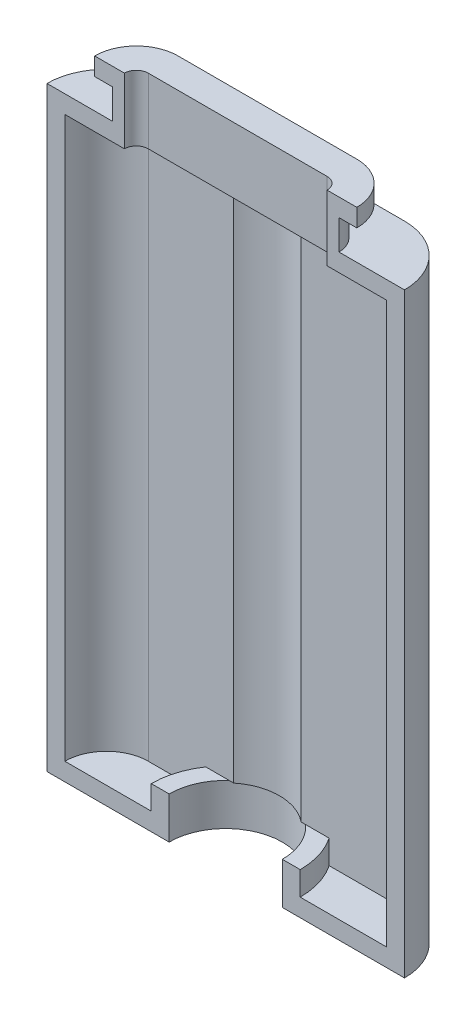
ISO-10303-21;
HEADER;
FILE_DESCRIPTION(('STEP AP214'),'2;1');
FILE_NAME('part.step','',(''),(''),'','','');
FILE_SCHEMA(('AUTOMOTIVE_DESIGN { 1 0 10303 214 1 1 1 1 }'));
ENDSEC;
DATA;
#1=APPLICATION_CONTEXT('core data for automotive mechanical design processes');
#2=APPLICATION_PROTOCOL_DEFINITION('international standard','automotive_design',2000,#1);
#3=PRODUCT_CONTEXT('',#1,'mechanical');
#4=PRODUCT('Part','Part','',(#3));
#5=PRODUCT_RELATED_PRODUCT_CATEGORY('part','',(#4));
#6=PRODUCT_DEFINITION_FORMATION('','',#4);
#7=PRODUCT_DEFINITION_CONTEXT('part definition',#1,'design');
#8=PRODUCT_DEFINITION('design','',#6,#7);
#9=PRODUCT_DEFINITION_SHAPE('','',#8);
#10=(LENGTH_UNIT() NAMED_UNIT(*) SI_UNIT(.MILLI.,.METRE.));
#11=(NAMED_UNIT(*) PLANE_ANGLE_UNIT() SI_UNIT($,.RADIAN.));
#12=(NAMED_UNIT(*) SI_UNIT($,.STERADIAN.) SOLID_ANGLE_UNIT());
#13=UNCERTAINTY_MEASURE_WITH_UNIT(LENGTH_MEASURE(1.E-05),#10,'distance_accuracy_value','');
#14=(GEOMETRIC_REPRESENTATION_CONTEXT(3) GLOBAL_UNCERTAINTY_ASSIGNED_CONTEXT((#13)) GLOBAL_UNIT_ASSIGNED_CONTEXT((#10,
#11,#12)) REPRESENTATION_CONTEXT('',''));
#15=CARTESIAN_POINT('',(0.,0.,0.));
#16=DIRECTION('',(0.,0.,1.));
#17=DIRECTION('',(1.,0.,0.));
#18=AXIS2_PLACEMENT_3D('',#15,#16,#17);
#19=CARTESIAN_POINT('',(0.,0.,0.));
#20=DIRECTION('',(0.,0.,1.));
#21=DIRECTION('',(1.,0.,0.));
#22=AXIS2_PLACEMENT_3D('',#19,#20,#21);
#23=PLANE('',#22);
#24=DIRECTION('',(1.,0.,0.));
#25=VECTOR('',#24,1.);
#26=CARTESIAN_POINT('',(0.,3.,0.));
#27=LINE('',#26,#25);
#28=CARTESIAN_POINT('',(-27.,3.,0.));
#29=VERTEX_POINT('',#28);
#30=CARTESIAN_POINT('',(-12.5,3.,0.));
#31=VERTEX_POINT('',#30);
#32=EDGE_CURVE('E237',#29,#31,#27,.T.);
#33=ORIENTED_EDGE('',*,*,#32,.F.);
#34=DIRECTION('',(0.,-1.,0.));
#35=VECTOR('',#34,1.);
#36=CARTESIAN_POINT('',(-27.,100.,0.));
#37=LINE('',#36,#35);
#38=CARTESIAN_POINT('',(-27.,97.0000000000001,0.));
#39=VERTEX_POINT('',#38);
#40=EDGE_CURVE('E251',#29,#39,#37,.F.);
#41=ORIENTED_EDGE('',*,*,#40,.T.);
#42=DIRECTION('',(1.,0.,0.));
#43=VECTOR('',#42,1.);
#44=CARTESIAN_POINT('',(0.,97.0000000000001,0.));
#45=LINE('',#44,#43);
#46=CARTESIAN_POINT('',(-17.,97.0000000000001,0.));
#47=VERTEX_POINT('',#46);
#48=EDGE_CURVE('E333',#39,#47,#45,.T.);
#49=ORIENTED_EDGE('',*,*,#48,.T.);
#50=DIRECTION('',(0.,1.,0.));
#51=VECTOR('',#50,1.);
#52=CARTESIAN_POINT('',(-17.,92.0000000000001,0.));
#53=LINE('',#52,#51);
#54=CARTESIAN_POINT('',(-17.,108.,0.));
#55=VERTEX_POINT('',#54);
#56=EDGE_CURVE('E340',#47,#55,#53,.T.);
#57=ORIENTED_EDGE('',*,*,#56,.T.);
#58=DIRECTION('',(1.,0.,0.));
#59=VECTOR('',#58,1.);
#60=CARTESIAN_POINT('',(15.,108.,0.));
#61=LINE('',#60,#59);
#62=CARTESIAN_POINT('',(-22.,108.,0.));
#63=VERTEX_POINT('',#62);
#64=EDGE_CURVE('E300',#63,#55,#61,.T.);
#65=ORIENTED_EDGE('',*,*,#64,.F.);
#66=DIRECTION('',(0.,-1.,0.));
#67=VECTOR('',#66,1.);
#68=CARTESIAN_POINT('',(-22.,108.,0.));
#69=LINE('',#68,#67);
#70=CARTESIAN_POINT('',(-22.,105.,0.));
#71=VERTEX_POINT('',#70);
#72=EDGE_CURVE('E329',#63,#71,#69,.T.);
#73=ORIENTED_EDGE('',*,*,#72,.T.);
#74=DIRECTION('',(1.,0.,0.));
#75=VECTOR('',#74,1.);
#76=CARTESIAN_POINT('',(15.,105.,0.));
#77=LINE('',#76,#75);
#78=CARTESIAN_POINT('',(-19.,105.,0.));
#79=VERTEX_POINT('',#78);
#80=EDGE_CURVE('E322',#71,#79,#77,.T.);
#81=ORIENTED_EDGE('',*,*,#80,.T.);
#82=DIRECTION('',(0.,-1.,0.));
#83=VECTOR('',#82,1.);
#84=CARTESIAN_POINT('',(-19.,105.,0.));
#85=LINE('',#84,#83);
#86=CARTESIAN_POINT('',(-19.,100.,0.));
#87=VERTEX_POINT('',#86);
#88=EDGE_CURVE('E316',#79,#87,#85,.T.);
#89=ORIENTED_EDGE('',*,*,#88,.T.);
#90=DIRECTION('',(1.,0.,0.));
#91=VECTOR('',#90,1.);
#92=CARTESIAN_POINT('',(0.,100.,0.));
#93=LINE('',#92,#91);
#94=CARTESIAN_POINT('',(-30.,100.,0.));
#95=VERTEX_POINT('',#94);
#96=EDGE_CURVE('E309',#95,#87,#93,.T.);
#97=ORIENTED_EDGE('',*,*,#96,.F.);
#98=DIRECTION('',(0.,-1.,0.));
#99=VECTOR('',#98,1.);
#100=CARTESIAN_POINT('',(-30.,100.,0.));
#101=LINE('',#100,#99);
#102=CARTESIAN_POINT('',(-30.,0.,0.));
#103=VERTEX_POINT('',#102);
#104=EDGE_CURVE('E288',#103,#95,#101,.F.);
#105=ORIENTED_EDGE('',*,*,#104,.F.);
#106=DIRECTION('',(1.,0.,0.));
#107=VECTOR('',#106,1.);
#108=CARTESIAN_POINT('',(0.,0.,0.));
#109=LINE('',#108,#107);
#110=CARTESIAN_POINT('',(-9.5,0.,0.));
#111=VERTEX_POINT('',#110);
#112=EDGE_CURVE('E312',#103,#111,#109,.T.);
#113=ORIENTED_EDGE('',*,*,#112,.T.);
#114=DIRECTION('',(0.,-1.,0.));
#115=VECTOR('',#114,1.);
#116=CARTESIAN_POINT('',(-9.5,7.,0.));
#117=LINE('',#116,#115);
#118=CARTESIAN_POINT('',(-9.5,7.,0.));
#119=VERTEX_POINT('',#118);
#120=EDGE_CURVE('E306',#119,#111,#117,.T.);
#121=ORIENTED_EDGE('',*,*,#120,.F.);
#122=DIRECTION('',(1.,0.,0.));
#123=VECTOR('',#122,1.);
#124=CARTESIAN_POINT('',(0.,7.,0.));
#125=LINE('',#124,#123);
#126=CARTESIAN_POINT('',(-12.5,7.,0.));
#127=VERTEX_POINT('',#126);
#128=EDGE_CURVE('E292',#127,#119,#125,.T.);
#129=ORIENTED_EDGE('',*,*,#128,.F.);
#130=DIRECTION('',(0.,-1.,0.));
#131=VECTOR('',#130,1.);
#132=CARTESIAN_POINT('',(-12.5,7.,0.));
#133=LINE('',#132,#131);
#134=EDGE_CURVE('E253',#127,#31,#133,.T.);
#135=ORIENTED_EDGE('',*,*,#134,.T.);
#136=EDGE_LOOP('',(#33,#41,#49,#57,#65,#73,#81,#89,#97,#105,#113,#121,#129,#135));
#137=FACE_BOUND('',#136,.T.);
#138=ADVANCED_FACE('F32',(#137),#23,.T.);
#139=DIRECTION('',(0.,-1.,0.));
#140=VECTOR('',#139,1.);
#141=CARTESIAN_POINT('',(9.5,7.,0.));
#142=LINE('',#141,#140);
#143=CARTESIAN_POINT('',(9.5,0.,0.));
#144=VERTEX_POINT('',#143);
#145=CARTESIAN_POINT('',(9.5,7.,0.));
#146=VERTEX_POINT('',#145);
#147=EDGE_CURVE('E303',#144,#146,#142,.F.);
#148=ORIENTED_EDGE('',*,*,#147,.F.);
#149=CARTESIAN_POINT('',(30.,0.,0.));
#150=VERTEX_POINT('',#149);
#151=EDGE_CURVE('E313',#144,#150,#109,.T.);
#152=ORIENTED_EDGE('',*,*,#151,.T.);
#153=DIRECTION('',(0.,-1.,0.));
#154=VECTOR('',#153,1.);
#155=CARTESIAN_POINT('',(30.,100.,0.));
#156=LINE('',#155,#154);
#157=CARTESIAN_POINT('',(30.,100.,0.));
#158=VERTEX_POINT('',#157);
#159=EDGE_CURVE('E261',#150,#158,#156,.F.);
#160=ORIENTED_EDGE('',*,*,#159,.T.);
#161=CARTESIAN_POINT('',(19.,100.,0.));
#162=VERTEX_POINT('',#161);
#163=EDGE_CURVE('E308',#162,#158,#93,.T.);
#164=ORIENTED_EDGE('',*,*,#163,.F.);
#165=DIRECTION('',(0.,-1.,0.));
#166=VECTOR('',#165,1.);
#167=CARTESIAN_POINT('',(19.,105.,0.));
#168=LINE('',#167,#166);
#169=CARTESIAN_POINT('',(19.,105.,0.));
#170=VERTEX_POINT('',#169);
#171=EDGE_CURVE('E319',#162,#170,#168,.F.);
#172=ORIENTED_EDGE('',*,*,#171,.T.);
#173=CARTESIAN_POINT('',(22.,105.,0.));
#174=VERTEX_POINT('',#173);
#175=EDGE_CURVE('E323',#170,#174,#77,.T.);
#176=ORIENTED_EDGE('',*,*,#175,.T.);
#177=DIRECTION('',(0.,-1.,0.));
#178=VECTOR('',#177,1.);
#179=CARTESIAN_POINT('',(22.,108.,0.));
#180=LINE('',#179,#178);
#181=CARTESIAN_POINT('',(22.,108.,0.));
#182=VERTEX_POINT('',#181);
#183=EDGE_CURVE('E326',#174,#182,#180,.F.);
#184=ORIENTED_EDGE('',*,*,#183,.T.);
#185=CARTESIAN_POINT('',(17.,108.,0.));
#186=VERTEX_POINT('',#185);
#187=EDGE_CURVE('E299',#186,#182,#61,.T.);
#188=ORIENTED_EDGE('',*,*,#187,.F.);
#189=DIRECTION('',(0.,1.,0.));
#190=VECTOR('',#189,1.);
#191=CARTESIAN_POINT('',(17.,92.0000000000001,0.));
#192=LINE('',#191,#190);
#193=CARTESIAN_POINT('',(17.,97.0000000000001,0.));
#194=VERTEX_POINT('',#193);
#195=EDGE_CURVE('E264',#186,#194,#192,.F.);
#196=ORIENTED_EDGE('',*,*,#195,.T.);
#197=CARTESIAN_POINT('',(27.,97.0000000000001,0.));
#198=VERTEX_POINT('',#197);
#199=EDGE_CURVE('E334',#194,#198,#45,.T.);
#200=ORIENTED_EDGE('',*,*,#199,.T.);
#201=DIRECTION('',(0.,-1.,0.));
#202=VECTOR('',#201,1.);
#203=CARTESIAN_POINT('',(27.,100.,0.));
#204=LINE('',#203,#202);
#205=CARTESIAN_POINT('',(27.,3.,0.));
#206=VERTEX_POINT('',#205);
#207=EDGE_CURVE('E274',#206,#198,#204,.F.);
#208=ORIENTED_EDGE('',*,*,#207,.F.);
#209=DIRECTION('',(1.,0.,0.));
#210=VECTOR('',#209,1.);
#211=CARTESIAN_POINT('',(0.,3.,0.));
#212=LINE('',#211,#210);
#213=CARTESIAN_POINT('',(12.5,3.,0.));
#214=VERTEX_POINT('',#213);
#215=EDGE_CURVE('E255',#214,#206,#212,.T.);
#216=ORIENTED_EDGE('',*,*,#215,.F.);
#217=DIRECTION('',(0.,-1.,0.));
#218=VECTOR('',#217,1.);
#219=CARTESIAN_POINT('',(12.5,7.,0.));
#220=LINE('',#219,#218);
#221=CARTESIAN_POINT('',(12.5,7.,0.));
#222=VERTEX_POINT('',#221);
#223=EDGE_CURVE('E337',#214,#222,#220,.F.);
#224=ORIENTED_EDGE('',*,*,#223,.T.);
#225=DIRECTION('',(1.,0.,0.));
#226=VECTOR('',#225,1.);
#227=CARTESIAN_POINT('',(0.,7.,0.));
#228=LINE('',#227,#226);
#229=EDGE_CURVE('E256',#146,#222,#228,.T.);
#230=ORIENTED_EDGE('',*,*,#229,.F.);
#231=EDGE_LOOP('',(#148,#152,#160,#164,#172,#176,#184,#188,#196,#200,#208,#216,#224,#230));
#232=FACE_BOUND('',#231,.T.);
#233=ADVANCED_FACE('F498',(#232),#23,.T.);
#234=CARTESIAN_POINT('',(0.,100.,0.));
#235=DIRECTION('',(0.,1.,0.));
#236=DIRECTION('',(0.,0.,1.));
#237=AXIS2_PLACEMENT_3D('',#234,#235,#236);
#238=PLANE('',#237);
#239=CARTESIAN_POINT('',(-20.,100.,0.));
#240=DIRECTION('',(0.,1.,0.));
#241=DIRECTION('',(0.,0.,1.));
#242=AXIS2_PLACEMENT_3D('',#239,#240,#241);
#243=CIRCLE('',#242,10.);
#244=CARTESIAN_POINT('',(-20.,100.,-10.));
#245=VERTEX_POINT('',#244);
#246=EDGE_CURVE('E486',#245,#95,#243,.T.);
#247=ORIENTED_EDGE('',*,*,#246,.T.);
#248=ORIENTED_EDGE('',*,*,#96,.T.);
#249=CARTESIAN_POINT('',(-15.,100.,0.));
#250=DIRECTION('',(0.,1.,0.));
#251=DIRECTION('',(0.,0.,1.));
#252=AXIS2_PLACEMENT_3D('',#249,#250,#251);
#253=CIRCLE('',#252,4.);
#254=CARTESIAN_POINT('',(-15.,100.,-4.));
#255=VERTEX_POINT('',#254);
#256=EDGE_CURVE('E365',#255,#87,#253,.T.);
#257=ORIENTED_EDGE('',*,*,#256,.F.);
#258=DIRECTION('',(1.,0.,0.));
#259=VECTOR('',#258,1.);
#260=CARTESIAN_POINT('',(0.,100.,-4.));
#261=LINE('',#260,#259);
#262=CARTESIAN_POINT('',(15.,100.,-4.00000000000001));
#263=VERTEX_POINT('',#262);
#264=EDGE_CURVE('E362',#255,#263,#261,.T.);
#265=ORIENTED_EDGE('',*,*,#264,.T.);
#266=CARTESIAN_POINT('',(15.,100.,0.));
#267=DIRECTION('',(0.,1.,0.));
#268=DIRECTION('',(0.,0.,1.));
#269=AXIS2_PLACEMENT_3D('',#266,#267,#268);
#270=CIRCLE('',#269,4.);
#271=EDGE_CURVE('E363',#162,#263,#270,.T.);
#272=ORIENTED_EDGE('',*,*,#271,.F.);
#273=ORIENTED_EDGE('',*,*,#163,.T.);
#274=CARTESIAN_POINT('',(20.,100.,0.));
#275=DIRECTION('',(0.,1.,0.));
#276=DIRECTION('',(0.,0.,1.));
#277=AXIS2_PLACEMENT_3D('',#274,#275,#276);
#278=CIRCLE('',#277,10.);
#279=CARTESIAN_POINT('',(20.,100.,-10.));
#280=VERTEX_POINT('',#279);
#281=EDGE_CURVE('E484',#158,#280,#278,.T.);
#282=ORIENTED_EDGE('',*,*,#281,.T.);
#283=DIRECTION('',(-1.,0.,0.));
#284=VECTOR('',#283,1.);
#285=CARTESIAN_POINT('',(6.63324958071081,100.,-10.));
#286=LINE('',#285,#284);
#287=CARTESIAN_POINT('',(6.63324958071081,100.,-10.));
#288=VERTEX_POINT('',#287);
#289=EDGE_CURVE('E458',#280,#288,#286,.T.);
#290=ORIENTED_EDGE('',*,*,#289,.T.);
#291=CARTESIAN_POINT('',(0.,100.,0.));
#292=DIRECTION('',(0.,1.,0.));
#293=DIRECTION('',(0.,0.,1.));
#294=AXIS2_PLACEMENT_3D('',#291,#292,#293);
#295=CIRCLE('',#294,12.);
#296=CARTESIAN_POINT('',(-6.6332495807108,100.,-10.));
#297=VERTEX_POINT('',#296);
#298=EDGE_CURVE('E461',#288,#297,#295,.T.);
#299=ORIENTED_EDGE('',*,*,#298,.T.);
#300=DIRECTION('',(-1.,0.,0.));
#301=VECTOR('',#300,1.);
#302=CARTESIAN_POINT('',(-30.,100.,-10.));
#303=LINE('',#302,#301);
#304=EDGE_CURVE('E463',#297,#245,#303,.T.);
#305=ORIENTED_EDGE('',*,*,#304,.T.);
#306=EDGE_LOOP('',(#247,#248,#257,#265,#272,#273,#282,#290,#299,#305));
#307=FACE_BOUND('',#306,.T.);
#308=ADVANCED_FACE('F521',(#307),#238,.T.);
#309=CARTESIAN_POINT('',(0.,0.,0.));
#310=DIRECTION('',(0.,1.,0.));
#311=DIRECTION('',(0.,0.,1.));
#312=AXIS2_PLACEMENT_3D('',#309,#310,#311);
#313=PLANE('',#312);
#314=ORIENTED_EDGE('',*,*,#112,.F.);
#315=CARTESIAN_POINT('',(-20.,0.,0.));
#316=DIRECTION('',(0.,1.,0.));
#317=DIRECTION('',(0.,0.,1.));
#318=AXIS2_PLACEMENT_3D('',#315,#316,#317);
#319=CIRCLE('',#318,10.);
#320=CARTESIAN_POINT('',(-20.,0.,-10.));
#321=VERTEX_POINT('',#320);
#322=EDGE_CURVE('E479',#103,#321,#319,.F.);
#323=ORIENTED_EDGE('',*,*,#322,.T.);
#324=DIRECTION('',(-1.,0.,0.));
#325=VECTOR('',#324,1.);
#326=CARTESIAN_POINT('',(-30.,0.,-10.));
#327=LINE('',#326,#325);
#328=CARTESIAN_POINT('',(-6.6332495807108,0.,-10.));
#329=VERTEX_POINT('',#328);
#330=EDGE_CURVE('E460',#329,#321,#327,.T.);
#331=ORIENTED_EDGE('',*,*,#330,.F.);
#332=CARTESIAN_POINT('',(0.,0.,0.));
#333=DIRECTION('',(0.,1.,0.));
#334=DIRECTION('',(0.,0.,1.));
#335=AXIS2_PLACEMENT_3D('',#332,#333,#334);
#336=CIRCLE('',#335,12.);
#337=CARTESIAN_POINT('',(6.63324958071081,0.,-10.));
#338=VERTEX_POINT('',#337);
#339=EDGE_CURVE('E468',#338,#329,#336,.T.);
#340=ORIENTED_EDGE('',*,*,#339,.F.);
#341=DIRECTION('',(-1.,0.,0.));
#342=VECTOR('',#341,1.);
#343=CARTESIAN_POINT('',(6.63324958071081,0.,-10.));
#344=LINE('',#343,#342);
#345=CARTESIAN_POINT('',(20.,0.,-10.));
#346=VERTEX_POINT('',#345);
#347=EDGE_CURVE('E291',#346,#338,#344,.T.);
#348=ORIENTED_EDGE('',*,*,#347,.F.);
#349=CARTESIAN_POINT('',(20.,0.,0.));
#350=DIRECTION('',(0.,1.,0.));
#351=DIRECTION('',(0.,0.,1.));
#352=AXIS2_PLACEMENT_3D('',#349,#350,#351);
#353=CIRCLE('',#352,10.);
#354=EDGE_CURVE('E477',#346,#150,#353,.F.);
#355=ORIENTED_EDGE('',*,*,#354,.T.);
#356=ORIENTED_EDGE('',*,*,#151,.F.);
#357=CARTESIAN_POINT('',(0.,0.,0.));
#358=DIRECTION('',(0.,1.,0.));
#359=DIRECTION('',(0.,0.,1.));
#360=AXIS2_PLACEMENT_3D('',#357,#358,#359);
#361=CIRCLE('',#360,9.5);
#362=EDGE_CURVE('E353',#144,#111,#361,.T.);
#363=ORIENTED_EDGE('',*,*,#362,.T.);
#364=EDGE_LOOP('',(#314,#323,#331,#340,#348,#355,#356,#363));
#365=FACE_BOUND('',#364,.T.);
#366=ADVANCED_FACE('F533',(#365),#313,.F.);
#367=CARTESIAN_POINT('',(0.,7.,0.));
#368=DIRECTION('',(0.,-1.,0.));
#369=DIRECTION('',(0.,0.,-1.));
#370=AXIS2_PLACEMENT_3D('',#367,#368,#369);
#371=CYLINDRICAL_SURFACE('',#370,9.5);
#372=CARTESIAN_POINT('',(0.,7.,0.));
#373=DIRECTION('',(0.,1.,0.));
#374=DIRECTION('',(0.,0.,1.));
#375=AXIS2_PLACEMENT_3D('',#372,#373,#374);
#376=CIRCLE('',#375,9.5);
#377=CARTESIAN_POINT('',(-6.42261628933256,7.00000000000001,-7.));
#378=VERTEX_POINT('',#377);
#379=EDGE_CURVE('E352',#378,#119,#376,.T.);
#380=ORIENTED_EDGE('',*,*,#379,.T.);
#381=ORIENTED_EDGE('',*,*,#120,.T.);
#382=ORIENTED_EDGE('',*,*,#362,.F.);
#383=ORIENTED_EDGE('',*,*,#147,.T.);
#384=CARTESIAN_POINT('',(6.42261628933256,7.,-7.));
#385=VERTEX_POINT('',#384);
#386=EDGE_CURVE('E290',#146,#385,#376,.T.);
#387=ORIENTED_EDGE('',*,*,#386,.T.);
#388=EDGE_CURVE('E351',#385,#378,#376,.T.);
#389=ORIENTED_EDGE('',*,*,#388,.T.);
#390=EDGE_LOOP('',(#380,#381,#382,#383,#387,#389));
#391=FACE_BOUND('',#390,.T.);
#392=ADVANCED_FACE('F34',(#391),#371,.F.);
#393=CARTESIAN_POINT('',(-15.,105.,0.));
#394=DIRECTION('',(0.,-1.,0.));
#395=DIRECTION('',(0.,0.,-1.));
#396=AXIS2_PLACEMENT_3D('',#393,#394,#395);
#397=CYLINDRICAL_SURFACE('',#396,4.);
#398=ORIENTED_EDGE('',*,*,#88,.F.);
#399=CARTESIAN_POINT('',(-15.,105.,0.));
#400=DIRECTION('',(0.,1.,0.));
#401=DIRECTION('',(0.,0.,1.));
#402=AXIS2_PLACEMENT_3D('',#399,#400,#401);
#403=CIRCLE('',#402,4.);
#404=CARTESIAN_POINT('',(-15.,105.,-4.));
#405=VERTEX_POINT('',#404);
#406=EDGE_CURVE('E359',#405,#79,#403,.T.);
#407=ORIENTED_EDGE('',*,*,#406,.F.);
#408=DIRECTION('',(0.,-1.,0.));
#409=VECTOR('',#408,1.);
#410=CARTESIAN_POINT('',(-15.,105.,-4.));
#411=LINE('',#410,#409);
#412=EDGE_CURVE('E452',#405,#255,#411,.T.);
#413=ORIENTED_EDGE('',*,*,#412,.T.);
#414=ORIENTED_EDGE('',*,*,#256,.T.);
#415=EDGE_LOOP('',(#398,#407,#413,#414));
#416=FACE_BOUND('',#415,.T.);
#417=ADVANCED_FACE('F516',(#416),#397,.T.);
#418=CARTESIAN_POINT('',(15.,105.,0.));
#419=DIRECTION('',(0.,-1.,0.));
#420=DIRECTION('',(0.,0.,-1.));
#421=AXIS2_PLACEMENT_3D('',#418,#419,#420);
#422=CYLINDRICAL_SURFACE('',#421,4.);
#423=ORIENTED_EDGE('',*,*,#171,.F.);
#424=ORIENTED_EDGE('',*,*,#271,.T.);
#425=DIRECTION('',(0.,-1.,0.));
#426=VECTOR('',#425,1.);
#427=CARTESIAN_POINT('',(15.,105.,-4.00000000000001));
#428=LINE('',#427,#426);
#429=CARTESIAN_POINT('',(15.,105.,-4.00000000000001));
#430=VERTEX_POINT('',#429);
#431=EDGE_CURVE('E356',#430,#263,#428,.T.);
#432=ORIENTED_EDGE('',*,*,#431,.F.);
#433=CARTESIAN_POINT('',(15.,105.,0.));
#434=DIRECTION('',(0.,1.,0.));
#435=DIRECTION('',(0.,0.,1.));
#436=AXIS2_PLACEMENT_3D('',#433,#434,#435);
#437=CIRCLE('',#436,4.);
#438=EDGE_CURVE('E357',#170,#430,#437,.T.);
#439=ORIENTED_EDGE('',*,*,#438,.F.);
#440=EDGE_LOOP('',(#423,#424,#432,#439));
#441=FACE_BOUND('',#440,.T.);
#442=ADVANCED_FACE('F508',(#441),#422,.T.);
#443=CARTESIAN_POINT('',(15.,105.,0.));
#444=DIRECTION('',(0.,1.,0.));
#445=DIRECTION('',(0.,0.,1.));
#446=AXIS2_PLACEMENT_3D('',#443,#444,#445);
#447=PLANE('',#446);
#448=ORIENTED_EDGE('',*,*,#80,.F.);
#449=CARTESIAN_POINT('',(-15.,105.,0.));
#450=DIRECTION('',(0.,1.,0.));
#451=DIRECTION('',(0.,0.,1.));
#452=AXIS2_PLACEMENT_3D('',#449,#450,#451);
#453=CIRCLE('',#452,7.);
#454=CARTESIAN_POINT('',(-15.,105.,-7.));
#455=VERTEX_POINT('',#454);
#456=EDGE_CURVE('E374',#455,#71,#453,.T.);
#457=ORIENTED_EDGE('',*,*,#456,.F.);
#458=DIRECTION('',(1.,0.,0.));
#459=VECTOR('',#458,1.);
#460=CARTESIAN_POINT('',(-15.,105.,-7.));
#461=LINE('',#460,#459);
#462=CARTESIAN_POINT('',(15.,105.,-7.00000000000001));
#463=VERTEX_POINT('',#462);
#464=EDGE_CURVE('E375',#455,#463,#461,.T.);
#465=ORIENTED_EDGE('',*,*,#464,.T.);
#466=CARTESIAN_POINT('',(15.,105.,0.));
#467=DIRECTION('',(0.,1.,0.));
#468=DIRECTION('',(0.,0.,1.));
#469=AXIS2_PLACEMENT_3D('',#466,#467,#468);
#470=CIRCLE('',#469,7.);
#471=EDGE_CURVE('E268',#174,#463,#470,.T.);
#472=ORIENTED_EDGE('',*,*,#471,.F.);
#473=ORIENTED_EDGE('',*,*,#175,.F.);
#474=ORIENTED_EDGE('',*,*,#438,.T.);
#475=DIRECTION('',(1.,0.,0.));
#476=VECTOR('',#475,1.);
#477=CARTESIAN_POINT('',(0.,105.,-4.));
#478=LINE('',#477,#476);
#479=EDGE_CURVE('E360',#405,#430,#478,.T.);
#480=ORIENTED_EDGE('',*,*,#479,.F.);
#481=ORIENTED_EDGE('',*,*,#406,.T.);
#482=EDGE_LOOP('',(#448,#457,#465,#472,#473,#474,#480,#481));
#483=FACE_BOUND('',#482,.T.);
#484=ADVANCED_FACE('F503',(#483),#447,.F.);
#485=CARTESIAN_POINT('',(15.,108.,0.));
#486=DIRECTION('',(0.,-1.,0.));
#487=DIRECTION('',(0.,0.,-1.));
#488=AXIS2_PLACEMENT_3D('',#485,#486,#487);
#489=CYLINDRICAL_SURFACE('',#488,7.);
#490=ORIENTED_EDGE('',*,*,#183,.F.);
#491=ORIENTED_EDGE('',*,*,#471,.T.);
#492=DIRECTION('',(0.,-1.,0.));
#493=VECTOR('',#492,1.);
#494=CARTESIAN_POINT('',(15.,108.,-7.00000000000001));
#495=LINE('',#494,#493);
#496=CARTESIAN_POINT('',(15.,108.,-7.00000000000001));
#497=VERTEX_POINT('',#496);
#498=EDGE_CURVE('E367',#497,#463,#495,.T.);
#499=ORIENTED_EDGE('',*,*,#498,.F.);
#500=CARTESIAN_POINT('',(15.,108.,0.));
#501=DIRECTION('',(0.,1.,0.));
#502=DIRECTION('',(0.,0.,1.));
#503=AXIS2_PLACEMENT_3D('',#500,#501,#502);
#504=CIRCLE('',#503,7.);
#505=EDGE_CURVE('E373',#182,#497,#504,.T.);
#506=ORIENTED_EDGE('',*,*,#505,.F.);
#507=EDGE_LOOP('',(#490,#491,#499,#506));
#508=FACE_BOUND('',#507,.T.);
#509=ADVANCED_FACE('F502',(#508),#489,.T.);
#510=CARTESIAN_POINT('',(-15.,108.,0.));
#511=DIRECTION('',(0.,-1.,0.));
#512=DIRECTION('',(0.,0.,-1.));
#513=AXIS2_PLACEMENT_3D('',#510,#511,#512);
#514=CYLINDRICAL_SURFACE('',#513,7.);
#515=ORIENTED_EDGE('',*,*,#72,.F.);
#516=CARTESIAN_POINT('',(-15.,108.,0.));
#517=DIRECTION('',(0.,1.,0.));
#518=DIRECTION('',(0.,0.,1.));
#519=AXIS2_PLACEMENT_3D('',#516,#517,#518);
#520=CIRCLE('',#519,7.);
#521=CARTESIAN_POINT('',(-15.,108.,-7.));
#522=VERTEX_POINT('',#521);
#523=EDGE_CURVE('E368',#522,#63,#520,.T.);
#524=ORIENTED_EDGE('',*,*,#523,.F.);
#525=DIRECTION('',(0.,-1.,0.));
#526=VECTOR('',#525,1.);
#527=CARTESIAN_POINT('',(-15.,108.,-7.));
#528=LINE('',#527,#526);
#529=EDGE_CURVE('E372',#522,#455,#528,.T.);
#530=ORIENTED_EDGE('',*,*,#529,.T.);
#531=ORIENTED_EDGE('',*,*,#456,.T.);
#532=EDGE_LOOP('',(#515,#524,#530,#531));
#533=FACE_BOUND('',#532,.T.);
#534=ADVANCED_FACE('F443',(#533),#514,.T.);
#535=CARTESIAN_POINT('',(15.,108.,0.));
#536=DIRECTION('',(0.,1.,0.));
#537=DIRECTION('',(0.,0.,1.));
#538=AXIS2_PLACEMENT_3D('',#535,#536,#537);
#539=PLANE('',#538);
#540=ORIENTED_EDGE('',*,*,#523,.T.);
#541=ORIENTED_EDGE('',*,*,#64,.T.);
#542=CARTESIAN_POINT('',(-15.,108.,0.));
#543=DIRECTION('',(0.,1.,0.));
#544=DIRECTION('',(0.,0.,1.));
#545=AXIS2_PLACEMENT_3D('',#542,#543,#544);
#546=CIRCLE('',#545,2.);
#547=CARTESIAN_POINT('',(-15.,108.,-2.));
#548=VERTEX_POINT('',#547);
#549=EDGE_CURVE('E11',#548,#55,#546,.T.);
#550=ORIENTED_EDGE('',*,*,#549,.F.);
#551=DIRECTION('',(1.,0.,0.));
#552=VECTOR('',#551,1.);
#553=CARTESIAN_POINT('',(15.,108.,-2.00000000000001));
#554=LINE('',#553,#552);
#555=CARTESIAN_POINT('',(15.,108.,-2.00000000000001));
#556=VERTEX_POINT('',#555);
#557=EDGE_CURVE('E277',#548,#556,#554,.T.);
#558=ORIENTED_EDGE('',*,*,#557,.T.);
#559=CARTESIAN_POINT('',(15.,108.,0.));
#560=DIRECTION('',(0.,1.,0.));
#561=DIRECTION('',(0.,0.,1.));
#562=AXIS2_PLACEMENT_3D('',#559,#560,#561);
#563=CIRCLE('',#562,2.);
#564=EDGE_CURVE('E40',#186,#556,#563,.T.);
#565=ORIENTED_EDGE('',*,*,#564,.F.);
#566=ORIENTED_EDGE('',*,*,#187,.T.);
#567=ORIENTED_EDGE('',*,*,#505,.T.);
#568=DIRECTION('',(1.,0.,0.));
#569=VECTOR('',#568,1.);
#570=CARTESIAN_POINT('',(-15.,108.,-7.));
#571=LINE('',#570,#569);
#572=EDGE_CURVE('E371',#522,#497,#571,.T.);
#573=ORIENTED_EDGE('',*,*,#572,.F.);
#574=EDGE_LOOP('',(#540,#541,#550,#558,#565,#566,#567,#573));
#575=FACE_BOUND('',#574,.T.);
#576=ADVANCED_FACE('F439',(#575),#539,.T.);
#577=CARTESIAN_POINT('',(0.,7.,0.));
#578=DIRECTION('',(0.,1.,0.));
#579=DIRECTION('',(0.,0.,1.));
#580=AXIS2_PLACEMENT_3D('',#577,#578,#579);
#581=PLANE('',#580);
#582=ORIENTED_EDGE('',*,*,#386,.F.);
#583=ORIENTED_EDGE('',*,*,#229,.T.);
#584=CARTESIAN_POINT('',(0.,7.,0.));
#585=DIRECTION('',(0.,1.,0.));
#586=DIRECTION('',(0.,0.,1.));
#587=AXIS2_PLACEMENT_3D('',#584,#585,#586);
#588=CIRCLE('',#587,12.5);
#589=CARTESIAN_POINT('',(10.356157588604,7.,-7.));
#590=VERTEX_POINT('',#589);
#591=EDGE_CURVE('E273',#222,#590,#588,.T.);
#592=ORIENTED_EDGE('',*,*,#591,.T.);
#593=DIRECTION('',(1.,0.,0.));
#594=VECTOR('',#593,1.);
#595=CARTESIAN_POINT('',(0.,7.,-7.));
#596=LINE('',#595,#594);
#597=EDGE_CURVE('E395',#385,#590,#596,.T.);
#598=ORIENTED_EDGE('',*,*,#597,.F.);
#599=EDGE_LOOP('',(#582,#583,#592,#598));
#600=FACE_BOUND('',#599,.T.);
#601=ADVANCED_FACE('F571',(#600),#581,.T.);
#602=CARTESIAN_POINT('',(0.,7.,0.));
#603=DIRECTION('',(0.,-1.,0.));
#604=DIRECTION('',(0.,0.,-1.));
#605=AXIS2_PLACEMENT_3D('',#602,#603,#604);
#606=CYLINDRICAL_SURFACE('',#605,12.5);
#607=ORIENTED_EDGE('',*,*,#134,.F.);
#608=CARTESIAN_POINT('',(-10.356157588604,7.,-7.));
#609=VERTEX_POINT('',#608);
#610=EDGE_CURVE('E270',#609,#127,#588,.T.);
#611=ORIENTED_EDGE('',*,*,#610,.F.);
#612=DIRECTION('',(0.,-1.,0.));
#613=VECTOR('',#612,1.);
#614=CARTESIAN_POINT('',(-10.356157588604,7.,-7.));
#615=LINE('',#614,#613);
#616=CARTESIAN_POINT('',(-10.356157588604,3.,-7.));
#617=VERTEX_POINT('',#616);
#618=EDGE_CURVE('E403',#609,#617,#615,.T.);
#619=ORIENTED_EDGE('',*,*,#618,.T.);
#620=CARTESIAN_POINT('',(0.,3.,0.));
#621=DIRECTION('',(0.,1.,0.));
#622=DIRECTION('',(0.,0.,1.));
#623=AXIS2_PLACEMENT_3D('',#620,#621,#622);
#624=CIRCLE('',#623,12.5);
#625=EDGE_CURVE('E275',#617,#31,#624,.T.);
#626=ORIENTED_EDGE('',*,*,#625,.T.);
#627=EDGE_LOOP('',(#607,#611,#619,#626));
#628=FACE_BOUND('',#627,.T.);
#629=ADVANCED_FACE('F616',(#628),#606,.T.);
#630=CARTESIAN_POINT('',(0.,3.,0.));
#631=DIRECTION('',(0.,1.,0.));
#632=DIRECTION('',(0.,0.,1.));
#633=AXIS2_PLACEMENT_3D('',#630,#631,#632);
#634=PLANE('',#633);
#635=CARTESIAN_POINT('',(-20.,3.,0.));
#636=DIRECTION('',(0.,1.,0.));
#637=DIRECTION('',(0.,0.,1.));
#638=AXIS2_PLACEMENT_3D('',#635,#636,#637);
#639=CIRCLE('',#638,7.);
#640=CARTESIAN_POINT('',(-20.,3.,-7.));
#641=VERTEX_POINT('',#640);
#642=EDGE_CURVE('E233',#29,#641,#639,.F.);
#643=ORIENTED_EDGE('',*,*,#642,.F.);
#644=ORIENTED_EDGE('',*,*,#32,.T.);
#645=ORIENTED_EDGE('',*,*,#625,.F.);
#646=DIRECTION('',(-1.,0.,0.));
#647=VECTOR('',#646,1.);
#648=CARTESIAN_POINT('',(-30.,3.,-7.));
#649=LINE('',#648,#647);
#650=EDGE_CURVE('E240',#617,#641,#649,.T.);
#651=ORIENTED_EDGE('',*,*,#650,.T.);
#652=EDGE_LOOP('',(#643,#644,#645,#651));
#653=FACE_BOUND('',#652,.T.);
#654=ADVANCED_FACE('F235',(#653),#634,.T.);
#655=CARTESIAN_POINT('',(0.,97.0000000000001,0.));
#656=DIRECTION('',(0.,1.,0.));
#657=DIRECTION('',(0.,0.,1.));
#658=AXIS2_PLACEMENT_3D('',#655,#656,#657);
#659=PLANE('',#658);
#660=ORIENTED_EDGE('',*,*,#48,.F.);
#661=CARTESIAN_POINT('',(-20.,97.0000000000001,0.));
#662=DIRECTION('',(0.,1.,0.));
#663=DIRECTION('',(0.,0.,1.));
#664=AXIS2_PLACEMENT_3D('',#661,#662,#663);
#665=CIRCLE('',#664,7.);
#666=CARTESIAN_POINT('',(-20.,97.0000000000001,-7.));
#667=VERTEX_POINT('',#666);
#668=EDGE_CURVE('E259',#667,#39,#665,.T.);
#669=ORIENTED_EDGE('',*,*,#668,.F.);
#670=DIRECTION('',(-1.,0.,0.));
#671=VECTOR('',#670,1.);
#672=CARTESIAN_POINT('',(-30.,97.0000000000001,-7.));
#673=LINE('',#672,#671);
#674=CARTESIAN_POINT('',(-5.65685424949238,97.0000000000001,-7.));
#675=VERTEX_POINT('',#674);
#676=EDGE_CURVE('E416',#675,#667,#673,.T.);
#677=ORIENTED_EDGE('',*,*,#676,.F.);
#678=CARTESIAN_POINT('',(0.,97.0000000000001,0.));
#679=DIRECTION('',(0.,1.,0.));
#680=DIRECTION('',(0.,0.,1.));
#681=AXIS2_PLACEMENT_3D('',#678,#679,#680);
#682=CIRCLE('',#681,9.);
#683=CARTESIAN_POINT('',(5.65685424949239,97.0000000000001,-7.));
#684=VERTEX_POINT('',#683);
#685=EDGE_CURVE('E422',#684,#675,#682,.T.);
#686=ORIENTED_EDGE('',*,*,#685,.F.);
#687=DIRECTION('',(-1.,0.,0.));
#688=VECTOR('',#687,1.);
#689=CARTESIAN_POINT('',(6.63324958071081,97.0000000000001,-7.));
#690=LINE('',#689,#688);
#691=CARTESIAN_POINT('',(20.,97.0000000000001,-7.));
#692=VERTEX_POINT('',#691);
#693=EDGE_CURVE('E412',#692,#684,#690,.T.);
#694=ORIENTED_EDGE('',*,*,#693,.F.);
#695=CARTESIAN_POINT('',(20.,97.0000000000001,0.));
#696=DIRECTION('',(0.,1.,0.));
#697=DIRECTION('',(0.,0.,1.));
#698=AXIS2_PLACEMENT_3D('',#695,#696,#697);
#699=CIRCLE('',#698,7.);
#700=EDGE_CURVE('E410',#198,#692,#699,.T.);
#701=ORIENTED_EDGE('',*,*,#700,.F.);
#702=ORIENTED_EDGE('',*,*,#199,.F.);
#703=CARTESIAN_POINT('',(15.,97.0000000000001,0.));
#704=DIRECTION('',(0.,1.,0.));
#705=DIRECTION('',(0.,0.,1.));
#706=AXIS2_PLACEMENT_3D('',#703,#704,#705);
#707=CIRCLE('',#706,2.);
#708=CARTESIAN_POINT('',(15.,97.0000000000001,-2.00000000000001));
#709=VERTEX_POINT('',#708);
#710=EDGE_CURVE('E347',#194,#709,#707,.T.);
#711=ORIENTED_EDGE('',*,*,#710,.T.);
#712=DIRECTION('',(1.,0.,0.));
#713=VECTOR('',#712,1.);
#714=CARTESIAN_POINT('',(0.,97.0000000000001,-2.));
#715=LINE('',#714,#713);
#716=CARTESIAN_POINT('',(-15.,97.0000000000001,-2.));
#717=VERTEX_POINT('',#716);
#718=EDGE_CURVE('E346',#717,#709,#715,.T.);
#719=ORIENTED_EDGE('',*,*,#718,.F.);
#720=CARTESIAN_POINT('',(-15.,97.0000000000001,0.));
#721=DIRECTION('',(0.,1.,0.));
#722=DIRECTION('',(0.,0.,1.));
#723=AXIS2_PLACEMENT_3D('',#720,#721,#722);
#724=CIRCLE('',#723,2.);
#725=EDGE_CURVE('E294',#717,#47,#724,.T.);
#726=ORIENTED_EDGE('',*,*,#725,.T.);
#727=EDGE_LOOP('',(#660,#669,#677,#686,#694,#701,#702,#711,#719,#726));
#728=FACE_BOUND('',#727,.T.);
#729=ADVANCED_FACE('F434',(#728),#659,.F.);
#730=CARTESIAN_POINT('',(10.356157588604,3.,-7.));
#731=VERTEX_POINT('',#730);
#732=EDGE_CURVE('E276',#214,#731,#624,.T.);
#733=ORIENTED_EDGE('',*,*,#732,.F.);
#734=ORIENTED_EDGE('',*,*,#215,.T.);
#735=CARTESIAN_POINT('',(20.,3.,0.));
#736=DIRECTION('',(0.,1.,0.));
#737=DIRECTION('',(0.,0.,1.));
#738=AXIS2_PLACEMENT_3D('',#735,#736,#737);
#739=CIRCLE('',#738,7.);
#740=CARTESIAN_POINT('',(20.,3.,-7.));
#741=VERTEX_POINT('',#740);
#742=EDGE_CURVE('E245',#741,#206,#739,.F.);
#743=ORIENTED_EDGE('',*,*,#742,.F.);
#744=DIRECTION('',(-1.,0.,0.));
#745=VECTOR('',#744,1.);
#746=CARTESIAN_POINT('',(6.63324958071081,3.,-7.));
#747=LINE('',#746,#745);
#748=EDGE_CURVE('E287',#741,#731,#747,.T.);
#749=ORIENTED_EDGE('',*,*,#748,.T.);
#750=EDGE_LOOP('',(#733,#734,#743,#749));
#751=FACE_BOUND('',#750,.T.);
#752=ADVANCED_FACE('F562',(#751),#634,.T.);
#753=ORIENTED_EDGE('',*,*,#223,.F.);
#754=ORIENTED_EDGE('',*,*,#732,.T.);
#755=DIRECTION('',(0.,-1.,0.));
#756=VECTOR('',#755,1.);
#757=CARTESIAN_POINT('',(10.356157588604,7.,-7.));
#758=LINE('',#757,#756);
#759=EDGE_CURVE('E400',#590,#731,#758,.T.);
#760=ORIENTED_EDGE('',*,*,#759,.F.);
#761=ORIENTED_EDGE('',*,*,#591,.F.);
#762=EDGE_LOOP('',(#753,#754,#760,#761));
#763=FACE_BOUND('',#762,.T.);
#764=ADVANCED_FACE('F566',(#763),#606,.T.);
#765=ORIENTED_EDGE('',*,*,#610,.T.);
#766=ORIENTED_EDGE('',*,*,#128,.T.);
#767=ORIENTED_EDGE('',*,*,#379,.F.);
#768=DIRECTION('',(-1.,0.,0.));
#769=VECTOR('',#768,1.);
#770=CARTESIAN_POINT('',(-30.,7.00000000000001,-7.));
#771=LINE('',#770,#769);
#772=EDGE_CURVE('E399',#378,#609,#771,.T.);
#773=ORIENTED_EDGE('',*,*,#772,.T.);
#774=EDGE_LOOP('',(#765,#766,#767,#773));
#775=FACE_BOUND('',#774,.T.);
#776=ADVANCED_FACE('F544',(#775),#581,.T.);
#777=CARTESIAN_POINT('',(-15.,92.0000000000001,0.));
#778=DIRECTION('',(0.,1.,0.));
#779=DIRECTION('',(0.,0.,1.));
#780=AXIS2_PLACEMENT_3D('',#777,#778,#779);
#781=CYLINDRICAL_SURFACE('',#780,2.);
#782=ORIENTED_EDGE('',*,*,#56,.F.);
#783=ORIENTED_EDGE('',*,*,#725,.F.);
#784=DIRECTION('',(0.,1.,0.));
#785=VECTOR('',#784,1.);
#786=CARTESIAN_POINT('',(-15.,92.0000000000001,-2.));
#787=LINE('',#786,#785);
#788=EDGE_CURVE('E53',#717,#548,#787,.T.);
#789=ORIENTED_EDGE('',*,*,#788,.T.);
#790=ORIENTED_EDGE('',*,*,#549,.T.);
#791=EDGE_LOOP('',(#782,#783,#789,#790));
#792=FACE_BOUND('',#791,.T.);
#793=ADVANCED_FACE('F438',(#792),#781,.F.);
#794=CARTESIAN_POINT('',(15.,92.0000000000001,0.));
#795=DIRECTION('',(0.,1.,0.));
#796=DIRECTION('',(0.,0.,1.));
#797=AXIS2_PLACEMENT_3D('',#794,#795,#796);
#798=CYLINDRICAL_SURFACE('',#797,2.);
#799=ORIENTED_EDGE('',*,*,#195,.F.);
#800=ORIENTED_EDGE('',*,*,#564,.T.);
#801=DIRECTION('',(0.,1.,0.));
#802=VECTOR('',#801,1.);
#803=CARTESIAN_POINT('',(15.,92.0000000000001,-2.00000000000001));
#804=LINE('',#803,#802);
#805=EDGE_CURVE('E279',#709,#556,#804,.T.);
#806=ORIENTED_EDGE('',*,*,#805,.F.);
#807=ORIENTED_EDGE('',*,*,#710,.F.);
#808=EDGE_LOOP('',(#799,#800,#806,#807));
#809=FACE_BOUND('',#808,.T.);
#810=ADVANCED_FACE('F493',(#809),#798,.F.);
#811=CARTESIAN_POINT('',(6.63324958071081,100.,-10.));
#812=DIRECTION('',(0.,0.,1.));
#813=DIRECTION('',(1.,0.,0.));
#814=AXIS2_PLACEMENT_3D('',#811,#812,#813);
#815=PLANE('',#814);
#816=ORIENTED_EDGE('',*,*,#289,.F.);
#817=DIRECTION('',(0.,-1.,0.));
#818=VECTOR('',#817,1.);
#819=CARTESIAN_POINT('',(20.,100.,-10.));
#820=LINE('',#819,#818);
#821=EDGE_CURVE('E348',#280,#346,#820,.T.);
#822=ORIENTED_EDGE('',*,*,#821,.T.);
#823=ORIENTED_EDGE('',*,*,#347,.T.);
#824=DIRECTION('',(0.,-1.,0.));
#825=VECTOR('',#824,1.);
#826=CARTESIAN_POINT('',(6.63324958071081,100.,-10.));
#827=LINE('',#826,#825);
#828=EDGE_CURVE('E474',#288,#338,#827,.T.);
#829=ORIENTED_EDGE('',*,*,#828,.F.);
#830=EDGE_LOOP('',(#816,#822,#823,#829));
#831=FACE_BOUND('',#830,.T.);
#832=ADVANCED_FACE('F582',(#831),#815,.F.);
#833=CARTESIAN_POINT('',(0.,100.,0.));
#834=DIRECTION('',(0.,-1.,0.));
#835=DIRECTION('',(0.,0.,-1.));
#836=AXIS2_PLACEMENT_3D('',#833,#834,#835);
#837=CYLINDRICAL_SURFACE('',#836,12.);
#838=ORIENTED_EDGE('',*,*,#339,.T.);
#839=DIRECTION('',(0.,-1.,0.));
#840=VECTOR('',#839,1.);
#841=CARTESIAN_POINT('',(-6.6332495807108,100.,-10.));
#842=LINE('',#841,#840);
#843=EDGE_CURVE('E466',#297,#329,#842,.T.);
#844=ORIENTED_EDGE('',*,*,#843,.F.);
#845=ORIENTED_EDGE('',*,*,#298,.F.);
#846=ORIENTED_EDGE('',*,*,#828,.T.);
#847=EDGE_LOOP('',(#838,#844,#845,#846));
#848=FACE_BOUND('',#847,.T.);
#849=ADVANCED_FACE('F585',(#848),#837,.T.);
#850=CARTESIAN_POINT('',(-30.,100.,-10.));
#851=DIRECTION('',(0.,0.,1.));
#852=DIRECTION('',(1.,0.,0.));
#853=AXIS2_PLACEMENT_3D('',#850,#851,#852);
#854=PLANE('',#853);
#855=ORIENTED_EDGE('',*,*,#330,.T.);
#856=DIRECTION('',(0.,-1.,0.));
#857=VECTOR('',#856,1.);
#858=CARTESIAN_POINT('',(-20.,100.,-10.));
#859=LINE('',#858,#857);
#860=EDGE_CURVE('E481',#321,#245,#859,.F.);
#861=ORIENTED_EDGE('',*,*,#860,.T.);
#862=ORIENTED_EDGE('',*,*,#304,.F.);
#863=ORIENTED_EDGE('',*,*,#843,.T.);
#864=EDGE_LOOP('',(#855,#861,#862,#863));
#865=FACE_BOUND('',#864,.T.);
#866=ADVANCED_FACE('F528',(#865),#854,.F.);
#867=CARTESIAN_POINT('',(-20.,100.,0.));
#868=DIRECTION('',(0.,-1.,0.));
#869=DIRECTION('',(0.,0.,-1.));
#870=AXIS2_PLACEMENT_3D('',#867,#868,#869);
#871=CYLINDRICAL_SURFACE('',#870,10.);
#872=ORIENTED_EDGE('',*,*,#246,.F.);
#873=ORIENTED_EDGE('',*,*,#860,.F.);
#874=ORIENTED_EDGE('',*,*,#322,.F.);
#875=ORIENTED_EDGE('',*,*,#104,.T.);
#876=EDGE_LOOP('',(#872,#873,#874,#875));
#877=FACE_BOUND('',#876,.T.);
#878=ADVANCED_FACE('F525',(#877),#871,.T.);
#879=CARTESIAN_POINT('',(20.,100.,0.));
#880=DIRECTION('',(0.,-1.,0.));
#881=DIRECTION('',(0.,0.,-1.));
#882=AXIS2_PLACEMENT_3D('',#879,#880,#881);
#883=CYLINDRICAL_SURFACE('',#882,10.);
#884=ORIENTED_EDGE('',*,*,#821,.F.);
#885=ORIENTED_EDGE('',*,*,#281,.F.);
#886=ORIENTED_EDGE('',*,*,#159,.F.);
#887=ORIENTED_EDGE('',*,*,#354,.F.);
#888=EDGE_LOOP('',(#884,#885,#886,#887));
#889=FACE_BOUND('',#888,.T.);
#890=ADVANCED_FACE('F576',(#889),#883,.T.);
#891=CARTESIAN_POINT('',(0.,7.,0.));
#892=DIRECTION('',(0.,1.,0.));
#893=DIRECTION('',(0.,0.,1.));
#894=AXIS2_PLACEMENT_3D('',#891,#892,#893);
#895=PLANE('',#894);
#896=CARTESIAN_POINT('',(0.,7.00000000000001,0.));
#897=DIRECTION('',(0.,1.,0.));
#898=DIRECTION('',(0.,0.,1.));
#899=AXIS2_PLACEMENT_3D('',#896,#897,#898);
#900=CIRCLE('',#899,9.);
#901=CARTESIAN_POINT('',(-5.65685424949238,7.00000000000001,-7.));
#902=VERTEX_POINT('',#901);
#903=CARTESIAN_POINT('',(5.65685424949239,7.,-7.));
#904=VERTEX_POINT('',#903);
#905=EDGE_CURVE('E384',#902,#904,#900,.F.);
#906=ORIENTED_EDGE('',*,*,#905,.F.);
#907=EDGE_CURVE('E396',#902,#378,#771,.T.);
#908=ORIENTED_EDGE('',*,*,#907,.T.);
#909=ORIENTED_EDGE('',*,*,#388,.F.);
#910=EDGE_CURVE('E392',#904,#385,#596,.T.);
#911=ORIENTED_EDGE('',*,*,#910,.F.);
#912=EDGE_LOOP('',(#906,#908,#909,#911));
#913=FACE_BOUND('',#912,.T.);
#914=ADVANCED_FACE('F549',(#913),#895,.F.);
#915=CARTESIAN_POINT('',(0.,105.,-4.));
#916=DIRECTION('',(0.,0.,-1.));
#917=DIRECTION('',(-1.,0.,0.));
#918=AXIS2_PLACEMENT_3D('',#915,#916,#917);
#919=PLANE('',#918);
#920=ORIENTED_EDGE('',*,*,#264,.F.);
#921=ORIENTED_EDGE('',*,*,#412,.F.);
#922=ORIENTED_EDGE('',*,*,#479,.T.);
#923=ORIENTED_EDGE('',*,*,#431,.T.);
#924=EDGE_LOOP('',(#920,#921,#922,#923));
#925=FACE_BOUND('',#924,.T.);
#926=ADVANCED_FACE('F511',(#925),#919,.T.);
#927=CARTESIAN_POINT('',(-15.,108.,-7.));
#928=DIRECTION('',(0.,0.,-1.));
#929=DIRECTION('',(-1.,0.,0.));
#930=AXIS2_PLACEMENT_3D('',#927,#928,#929);
#931=PLANE('',#930);
#932=ORIENTED_EDGE('',*,*,#464,.F.);
#933=ORIENTED_EDGE('',*,*,#529,.F.);
#934=ORIENTED_EDGE('',*,*,#572,.T.);
#935=ORIENTED_EDGE('',*,*,#498,.T.);
#936=EDGE_LOOP('',(#932,#933,#934,#935));
#937=FACE_BOUND('',#936,.T.);
#938=ADVANCED_FACE('F448',(#937),#931,.T.);
#939=CARTESIAN_POINT('',(6.63324958071081,100.,-7.));
#940=DIRECTION('',(0.,0.,1.));
#941=DIRECTION('',(1.,0.,0.));
#942=AXIS2_PLACEMENT_3D('',#939,#940,#941);
#943=PLANE('',#942);
#944=ORIENTED_EDGE('',*,*,#910,.T.);
#945=ORIENTED_EDGE('',*,*,#597,.T.);
#946=ORIENTED_EDGE('',*,*,#759,.T.);
#947=ORIENTED_EDGE('',*,*,#748,.F.);
#948=DIRECTION('',(0.,1.,0.));
#949=VECTOR('',#948,1.);
#950=CARTESIAN_POINT('',(20.,100.,-7.));
#951=LINE('',#950,#949);
#952=EDGE_CURVE('E405',#692,#741,#951,.F.);
#953=ORIENTED_EDGE('',*,*,#952,.F.);
#954=ORIENTED_EDGE('',*,*,#693,.T.);
#955=DIRECTION('',(0.,-1.,0.));
#956=VECTOR('',#955,1.);
#957=CARTESIAN_POINT('',(5.65685424949239,97.0000000000001,-7.));
#958=LINE('',#957,#956);
#959=EDGE_CURVE('E407',#684,#904,#958,.T.);
#960=ORIENTED_EDGE('',*,*,#959,.T.);
#961=EDGE_LOOP('',(#944,#945,#946,#947,#953,#954,#960));
#962=FACE_BOUND('',#961,.T.);
#963=ADVANCED_FACE('F555',(#962),#943,.T.);
#964=CARTESIAN_POINT('',(0.,100.,0.));
#965=DIRECTION('',(0.,-1.,0.));
#966=DIRECTION('',(0.,0.,-1.));
#967=AXIS2_PLACEMENT_3D('',#964,#965,#966);
#968=CYLINDRICAL_SURFACE('',#967,9.);
#969=ORIENTED_EDGE('',*,*,#905,.T.);
#970=ORIENTED_EDGE('',*,*,#959,.F.);
#971=ORIENTED_EDGE('',*,*,#685,.T.);
#972=DIRECTION('',(0.,-1.,0.));
#973=VECTOR('',#972,1.);
#974=CARTESIAN_POINT('',(-5.65685424949238,97.0000000000001,-7.));
#975=LINE('',#974,#973);
#976=EDGE_CURVE('E413',#675,#902,#975,.T.);
#977=ORIENTED_EDGE('',*,*,#976,.T.);
#978=EDGE_LOOP('',(#969,#970,#971,#977));
#979=FACE_BOUND('',#978,.T.);
#980=ADVANCED_FACE('F553',(#979),#968,.F.);
#981=CARTESIAN_POINT('',(-30.,100.,-7.));
#982=DIRECTION('',(0.,0.,1.));
#983=DIRECTION('',(1.,0.,0.));
#984=AXIS2_PLACEMENT_3D('',#981,#982,#983);
#985=PLANE('',#984);
#986=ORIENTED_EDGE('',*,*,#976,.F.);
#987=ORIENTED_EDGE('',*,*,#676,.T.);
#988=DIRECTION('',(0.,1.,0.));
#989=VECTOR('',#988,1.);
#990=CARTESIAN_POINT('',(-20.,100.,-7.));
#991=LINE('',#990,#989);
#992=EDGE_CURVE('E246',#641,#667,#991,.T.);
#993=ORIENTED_EDGE('',*,*,#992,.F.);
#994=ORIENTED_EDGE('',*,*,#650,.F.);
#995=ORIENTED_EDGE('',*,*,#618,.F.);
#996=ORIENTED_EDGE('',*,*,#772,.F.);
#997=ORIENTED_EDGE('',*,*,#907,.F.);
#998=EDGE_LOOP('',(#986,#987,#993,#994,#995,#996,#997));
#999=FACE_BOUND('',#998,.T.);
#1000=ADVANCED_FACE('F431',(#999),#985,.T.);
#1001=CARTESIAN_POINT('',(-20.,100.,0.));
#1002=DIRECTION('',(0.,-1.,0.));
#1003=DIRECTION('',(0.,0.,-1.));
#1004=AXIS2_PLACEMENT_3D('',#1001,#1002,#1003);
#1005=CYLINDRICAL_SURFACE('',#1004,7.);
#1006=ORIENTED_EDGE('',*,*,#668,.T.);
#1007=ORIENTED_EDGE('',*,*,#40,.F.);
#1008=ORIENTED_EDGE('',*,*,#642,.T.);
#1009=ORIENTED_EDGE('',*,*,#992,.T.);
#1010=EDGE_LOOP('',(#1006,#1007,#1008,#1009));
#1011=FACE_BOUND('',#1010,.T.);
#1012=ADVANCED_FACE('F258',(#1011),#1005,.F.);
#1013=CARTESIAN_POINT('',(20.,100.,0.));
#1014=DIRECTION('',(0.,-1.,0.));
#1015=DIRECTION('',(0.,0.,-1.));
#1016=AXIS2_PLACEMENT_3D('',#1013,#1014,#1015);
#1017=CYLINDRICAL_SURFACE('',#1016,7.);
#1018=ORIENTED_EDGE('',*,*,#952,.T.);
#1019=ORIENTED_EDGE('',*,*,#742,.T.);
#1020=ORIENTED_EDGE('',*,*,#207,.T.);
#1021=ORIENTED_EDGE('',*,*,#700,.T.);
#1022=EDGE_LOOP('',(#1018,#1019,#1020,#1021));
#1023=FACE_BOUND('',#1022,.T.);
#1024=ADVANCED_FACE('F560',(#1023),#1017,.F.);
#1025=CARTESIAN_POINT('',(15.,92.0000000000001,-2.00000000000001));
#1026=DIRECTION('',(0.,0.,1.));
#1027=DIRECTION('',(1.,0.,0.));
#1028=AXIS2_PLACEMENT_3D('',#1025,#1026,#1027);
#1029=PLANE('',#1028);
#1030=ORIENTED_EDGE('',*,*,#718,.T.);
#1031=ORIENTED_EDGE('',*,*,#805,.T.);
#1032=ORIENTED_EDGE('',*,*,#557,.F.);
#1033=ORIENTED_EDGE('',*,*,#788,.F.);
#1034=EDGE_LOOP('',(#1030,#1031,#1032,#1033));
#1035=FACE_BOUND('',#1034,.T.);
#1036=ADVANCED_FACE('F492',(#1035),#1029,.T.);
#1037=CLOSED_SHELL('',(#138,#233,#308,#366,#392,#417,#442,#484,#509,#534,#576,#601,#629,#654,
#729,#752,#764,#776,#793,#810,#832,#849,#866,#878,#890,#914,#926,#938,#963,#980,#1000,#1012,
#1024,#1036));
#1038=MANIFOLD_SOLID_BREP('B2',#1037);
#1039=ADVANCED_BREP_SHAPE_REPRESENTATION('',(#18,#1038),#14);
#1040=SHAPE_DEFINITION_REPRESENTATION(#9,#1039);
ENDSEC;
END-ISO-10303-21;
